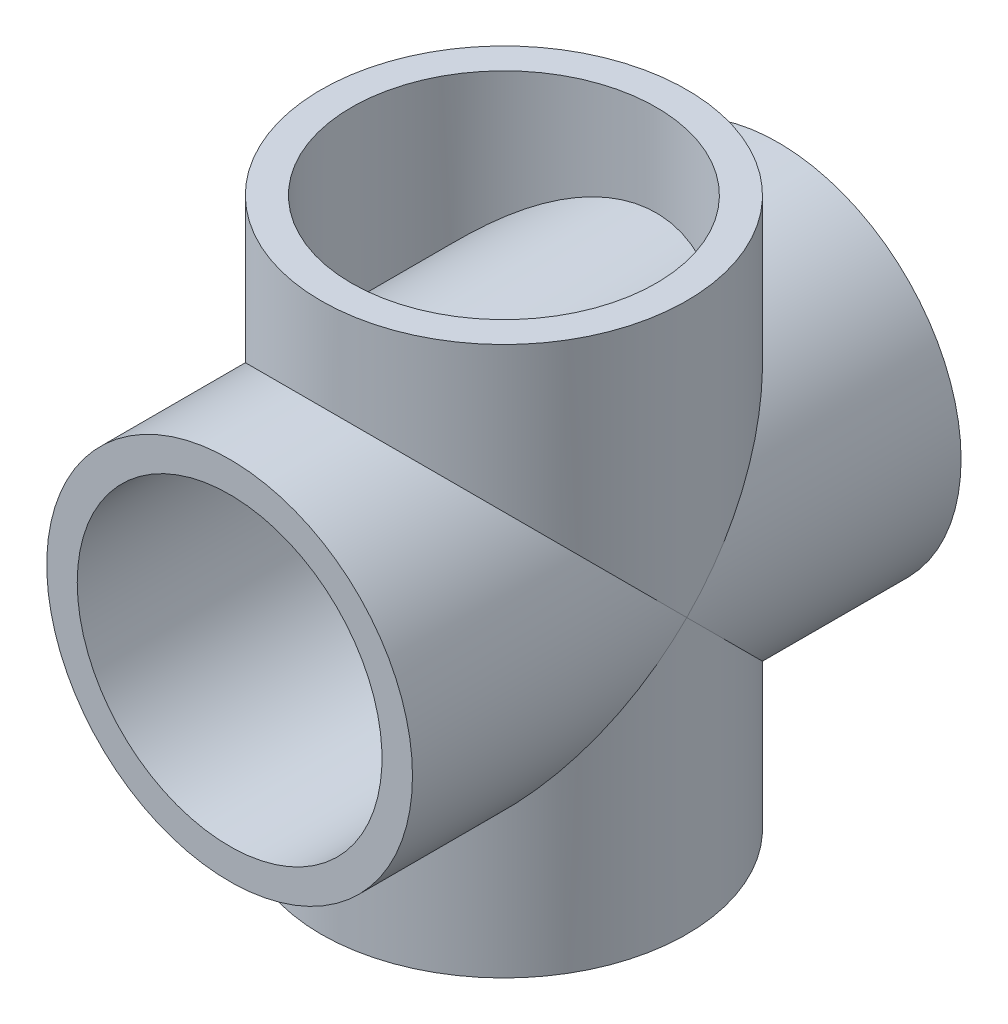
ISO-10303-21;
HEADER;
FILE_DESCRIPTION(('STEP AP214'),'2;1');
FILE_NAME('part.step','',(''),(''),'','','');
FILE_SCHEMA(('AUTOMOTIVE_DESIGN { 1 0 10303 214 1 1 1 1 }'));
ENDSEC;
DATA;
#1=APPLICATION_CONTEXT('core data for automotive mechanical design processes');
#2=APPLICATION_PROTOCOL_DEFINITION('international standard','automotive_design',2000,#1);
#3=PRODUCT_CONTEXT('',#1,'mechanical');
#4=PRODUCT('Part','Part','',(#3));
#5=PRODUCT_RELATED_PRODUCT_CATEGORY('part','',(#4));
#6=PRODUCT_DEFINITION_FORMATION('','',#4);
#7=PRODUCT_DEFINITION_CONTEXT('part definition',#1,'design');
#8=PRODUCT_DEFINITION('design','',#6,#7);
#9=PRODUCT_DEFINITION_SHAPE('','',#8);
#10=(LENGTH_UNIT() NAMED_UNIT(*) SI_UNIT(.MILLI.,.METRE.));
#11=(NAMED_UNIT(*) PLANE_ANGLE_UNIT() SI_UNIT($,.RADIAN.));
#12=(NAMED_UNIT(*) SI_UNIT($,.STERADIAN.) SOLID_ANGLE_UNIT());
#13=UNCERTAINTY_MEASURE_WITH_UNIT(LENGTH_MEASURE(1.E-05),#10,'distance_accuracy_value','');
#14=(GEOMETRIC_REPRESENTATION_CONTEXT(3) GLOBAL_UNCERTAINTY_ASSIGNED_CONTEXT((#13)) GLOBAL_UNIT_ASSIGNED_CONTEXT((#10,
#11,#12)) REPRESENTATION_CONTEXT('',''));
#15=CARTESIAN_POINT('',(0.,0.,0.));
#16=DIRECTION('',(0.,0.,1.));
#17=DIRECTION('',(1.,0.,0.));
#18=AXIS2_PLACEMENT_3D('',#15,#16,#17);
#19=CARTESIAN_POINT('',(0.,-9.,0.));
#20=DIRECTION('',(0.,1.,0.));
#21=DIRECTION('',(0.,0.,1.));
#22=AXIS2_PLACEMENT_3D('',#19,#20,#21);
#23=CYLINDRICAL_SURFACE('',#22,5.);
#24=CARTESIAN_POINT('',(0.,-6.,5.));
#25=CARTESIAN_POINT('',(0.118803401095405,-6.00000636279643,5.0000064862677));
#26=CARTESIAN_POINT('',(0.237558182871218,-5.9964675633917,4.99576243276274));
#27=CARTESIAN_POINT('',(0.474087838067091,-5.98241218121961,4.97888342242901));
#28=CARTESIAN_POINT('',(0.591862597565708,-5.97189479839916,4.96624750352265));
#29=CARTESIAN_POINT('',(0.825474733693952,-5.94410935213455,4.93280067838579));
#30=CARTESIAN_POINT('',(0.941311384241482,-5.92683881527392,4.9119867768663));
#31=CARTESIAN_POINT('',(1.17018155731566,-5.88593383048318,4.86255145148515));
#32=CARTESIAN_POINT('',(1.28321381003106,-5.86229655516696,4.83392655878944));
#33=CARTESIAN_POINT('',(1.61550772291657,-5.78287450226039,4.73740362240781));
#34=CARTESIAN_POINT('',(1.82964493287683,-5.71836951829061,4.65860789353558));
#35=CARTESIAN_POINT('',(2.23973970904935,-5.57056793109677,4.47594785576944));
#36=CARTESIAN_POINT('',(2.43569110189251,-5.48726497939233,4.37207507698348));
#37=CARTESIAN_POINT('',(2.7487493551036,-5.33520303254702,4.17931765246547));
#38=CARTESIAN_POINT('',(2.87121824175386,-5.27015451867263,4.09605321766379));
#39=CARTESIAN_POINT('',(3.10654667374618,-5.13495608214751,3.92057491487891));
#40=CARTESIAN_POINT('',(3.21940634431806,-5.06480622600091,3.82836116355909));
#41=CARTESIAN_POINT('',(3.43568816068562,-4.92066908923446,3.63553308278675));
#42=CARTESIAN_POINT('',(3.53908406033977,-4.84667197890407,3.53489678957743));
#43=CARTESIAN_POINT('',(3.73607907111508,-4.69649318853079,3.32600704379389));
#44=CARTESIAN_POINT('',(3.82967941338621,-4.62031178455679,3.21775455132494));
#45=CARTESIAN_POINT('',(4.00872533168448,-4.46590940619064,2.99186847524311));
#46=CARTESIAN_POINT('',(4.09398918746846,-4.38767669457347,2.87409893732901));
#47=CARTESIAN_POINT('',(4.25431125048952,-4.23240914046916,2.63097870098595));
#48=CARTESIAN_POINT('',(4.32936604026974,-4.15537470670733,2.50562548412932));
#49=CARTESIAN_POINT('',(4.46882104937819,-4.00501156130571,2.24746866950541));
#50=CARTESIAN_POINT('',(4.53324636625594,-3.93167441297209,2.11468364253878));
#51=CARTESIAN_POINT('',(4.65107409789266,-3.79155403229088,1.84110422364287));
#52=CARTESIAN_POINT('',(4.70448590476211,-3.72476524134073,1.70031678782893));
#53=CARTESIAN_POINT('',(4.8038705578035,-3.59583630496641,1.39667622874439));
#54=CARTESIAN_POINT('',(4.8486776643058,-3.53471789619366,1.23299156369288));
#55=CARTESIAN_POINT('',(4.92202476595886,-3.43187191424554,0.896180811817698));
#56=CARTESIAN_POINT('',(4.95060424437364,-3.39009732197608,0.723078773763434));
#57=CARTESIAN_POINT('',(4.97982440219376,-3.34688431376343,0.457661896369311));
#58=CARTESIAN_POINT('',(4.98729261982802,-3.33571370000033,0.367618679010191));
#59=CARTESIAN_POINT('',(4.99733565959028,-3.3206515347262,0.186635888055955));
#60=CARTESIAN_POINT('',(4.99991093928053,-3.31675930257913,0.09569639907507));
#61=CARTESIAN_POINT('',(5.00008454722765,-3.31649708247112,-0.0861953552895042));
#62=CARTESIAN_POINT('',(4.99768286475912,-3.32012711072076,-0.177147620700304));
#63=CARTESIAN_POINT('',(4.98797701095387,-3.33469045716225,-0.358199787378117));
#64=CARTESIAN_POINT('',(4.9806722424497,-3.34562466496004,-0.448299583463617));
#65=CARTESIAN_POINT('',(4.9605577711742,-3.37538324774709,-0.63429034598752));
#66=CARTESIAN_POINT('',(4.94734291419499,-3.3947851529219,-0.730044329719766));
#67=CARTESIAN_POINT('',(4.9157405398429,-3.44038747060614,-0.919072038911219));
#68=CARTESIAN_POINT('',(4.89734936269663,-3.46659269219059,-1.01234395824117));
#69=CARTESIAN_POINT('',(4.83487145070514,-3.55374344299518,-1.28826795172829));
#70=CARTESIAN_POINT('',(4.78352415648848,-3.62315426397916,-1.46664526370663));
#71=CARTESIAN_POINT('',(4.67632227850057,-3.76004871810486,-1.77568076874675));
#72=CARTESIAN_POINT('',(4.62355194613134,-3.82500795712383,-1.90862269999418));
#73=CARTESIAN_POINT('',(4.50808681272013,-3.96043831206372,-2.16730339944136));
#74=CARTESIAN_POINT('',(4.44538619181528,-4.03091264789804,-2.29303788433664));
#75=CARTESIAN_POINT('',(4.31043075762212,-4.17491879023624,-2.53766285158917));
#76=CARTESIAN_POINT('',(4.23816312441515,-4.24845460689311,-2.65654383781025));
#77=CARTESIAN_POINT('',(4.08435401417139,-4.39652708661221,-2.88743564285202));
#78=CARTESIAN_POINT('',(4.00281439970954,-4.47106354601934,-2.99944783455588));
#79=CARTESIAN_POINT('',(3.82600354374306,-4.62342077684068,-3.22226109628928));
#80=CARTESIAN_POINT('',(3.73023700414124,-4.70120929265264,-3.33269201981388));
#81=CARTESIAN_POINT('',(3.52848927170201,-4.85446404087317,-3.54559939981486));
#82=CARTESIAN_POINT('',(3.42250656330085,-4.92992992652313,-3.64807467199064));
#83=CARTESIAN_POINT('',(3.20056123189973,-5.07681645366273,-3.84425294796649));
#84=CARTESIAN_POINT('',(3.08461970676718,-5.14824514018381,-3.9379736595021));
#85=CARTESIAN_POINT('',(2.84274064052496,-5.28566109460446,-4.11599426421234));
#86=CARTESIAN_POINT('',(2.71680273442448,-5.35164816363854,-4.20029381312783));
#87=CARTESIAN_POINT('',(2.38827463214803,-5.50853314592501,-4.39878554184217));
#88=CARTESIAN_POINT('',(2.17932731194453,-5.59498946786027,-4.50631929530225));
#89=CARTESIAN_POINT('',(1.8513717036081,-5.7084038705407,-4.64613821914312));
#90=CARTESIAN_POINT('',(1.73959798407547,-5.74350440601256,-4.68917312218695));
#91=CARTESIAN_POINT('',(1.51170856686385,-5.80764297166477,-4.76751793421716));
#92=CARTESIAN_POINT('',(1.39559507719869,-5.83668403661188,-4.80283171060456));
#93=CARTESIAN_POINT('',(1.15874024023432,-5.88830518104936,-4.86543453319276));
#94=CARTESIAN_POINT('',(1.03796855116844,-5.91082981449132,-4.89265476556204));
#95=CARTESIAN_POINT('',(0.793680719841949,-5.94855722519953,-4.93816722227972));
#96=CARTESIAN_POINT('',(0.670165967971718,-5.96376362711192,-4.95646386645159));
#97=CARTESIAN_POINT('',(0.42144390913128,-5.98648272603519,-4.98377697031546));
#98=CARTESIAN_POINT('',(0.296237084023917,-5.99399756851713,-4.99279601788868));
#99=CARTESIAN_POINT('',(0.0452813606587585,-6.00114166173048,-5.00137053830483));
#100=CARTESIAN_POINT('',(-0.0804674771283864,-6.00077177047715,-5.00092704086014));
#101=CARTESIAN_POINT('',(-0.316217699577986,-5.99267919208227,-4.9912131909085));
#102=CARTESIAN_POINT('',(-0.426296149457819,-5.98584511760915,-4.98300958868131));
#103=CARTESIAN_POINT('',(-0.645178571447254,-5.96622340308935,-4.95942180024422));
#104=CARTESIAN_POINT('',(-0.753982136950648,-5.95343391393135,-4.94403538382096));
#105=CARTESIAN_POINT('',(-0.96950893257834,-5.922153588973,-4.90632392627914));
#106=CARTESIAN_POINT('',(-1.07623280976896,-5.90366455762228,-4.88400108118507));
#107=CARTESIAN_POINT('',(-1.28701083316512,-5.86132925877314,-4.83274114539643));
#108=CARTESIAN_POINT('',(-1.39106394571243,-5.83748095091222,-4.80380153552005));
#109=CARTESIAN_POINT('',(-1.70100357204864,-5.75780997966539,-4.70677908129298));
#110=CARTESIAN_POINT('',(-1.90197317990273,-5.69426548906173,-4.62897463511253));
#111=CARTESIAN_POINT('',(-2.28736622034062,-5.55070829820292,-4.45119251532421));
#112=CARTESIAN_POINT('',(-2.4717835011244,-5.47068951124314,-4.35120664535609));
#113=CARTESIAN_POINT('',(-2.77431022087587,-5.32196402989805,-4.16241303362758));
#114=CARTESIAN_POINT('',(-2.89671891082123,-5.25618753965957,-4.07807881363138));
#115=CARTESIAN_POINT('',(-3.13182124456801,-5.11958730343164,-3.90043631108395));
#116=CARTESIAN_POINT('',(-3.24451452031805,-5.04876336641404,-3.80712768883631));
#117=CARTESIAN_POINT('',(-3.46039828484842,-4.9033290991082,-3.61204642318574));
#118=CARTESIAN_POINT('',(-3.5635591655786,-4.82870801884464,-3.51024916115611));
#119=CARTESIAN_POINT('',(-3.75997885952874,-4.67738428016308,-3.29899388009149));
#120=CARTESIAN_POINT('',(-3.85323906840847,-4.60068191705467,-3.18953694443026));
#121=CARTESIAN_POINT('',(-4.03144708201688,-4.44540721169772,-2.96121350414877));
#122=CARTESIAN_POINT('',(-4.11621624228699,-4.3668259708409,-2.84221365304651));
#123=CARTESIAN_POINT('',(-4.27543853436326,-4.21106013919063,-2.59654816531047));
#124=CARTESIAN_POINT('',(-4.34988795406828,-4.13387605960317,-2.46987979366074));
#125=CARTESIAN_POINT('',(-4.48797579821677,-3.98352281099524,-2.20902653418022));
#126=CARTESIAN_POINT('',(-4.55164272839413,-3.91034341321279,-2.07486275313425));
#127=CARTESIAN_POINT('',(-4.66777738062598,-3.77095158572992,-1.79841659242433));
#128=CARTESIAN_POINT('',(-4.72025536508448,-3.70473280033071,-1.6561418052561));
#129=CARTESIAN_POINT('',(-4.81674752553354,-3.57850891369613,-1.35146946258282));
#130=CARTESIAN_POINT('',(-4.85976816309609,-3.51940536010279,-1.18836978046225));
#131=CARTESIAN_POINT('',(-4.92964324178358,-3.42087013106355,-0.85305750676159));
#132=CARTESIAN_POINT('',(-4.95653805629938,-3.38138936984465,-0.680868858020014));
#133=CARTESIAN_POINT('',(-4.98335884043903,-3.34161185607347,-0.417267118823414));
#134=CARTESIAN_POINT('',(-4.9900439743412,-3.33159299706687,-0.327939885729364));
#135=CARTESIAN_POINT('',(-4.99859875462369,-3.31874657694375,-0.148522532583947));
#136=CARTESIAN_POINT('',(-5.00046880529626,-3.31591841207014,-0.058432477219275));
#137=CARTESIAN_POINT('',(-4.99933140644564,-3.31763235091844,0.121644228189401));
#138=CARTESIAN_POINT('',(-4.99632384110741,-3.32217462964556,0.2116308757273));
#139=CARTESIAN_POINT('',(-4.98551920595953,-3.33836659549378,0.390705731690927));
#140=CARTESIAN_POINT('',(-4.97771962684741,-3.3500200062847,0.479793444537629));
#141=CARTESIAN_POINT('',(-4.95646386284238,-3.38139896959306,0.665670000297205));
#142=CARTESIAN_POINT('',(-4.94249693749092,-3.40184751901396,0.762277582327921));
#143=CARTESIAN_POINT('',(-4.90931375512976,-3.44956299936088,0.952897655384544));
#144=CARTESIAN_POINT('',(-4.89009367595844,-3.47683489368277,1.0469082017716));
#145=CARTESIAN_POINT('',(-4.82502893529809,-3.56715037769761,1.32490519247802));
#146=CARTESIAN_POINT('',(-4.7718260132866,-3.6386203494625,1.50447425917308));
#147=CARTESIAN_POINT('',(-4.66101333620415,-3.77905708413607,1.81560530153226));
#148=CARTESIAN_POINT('',(-4.60651894445035,-3.84555788327452,1.94948557461558));
#149=CARTESIAN_POINT('',(-4.48741065580201,-3.98390215298827,2.2098947178368));
#150=CARTESIAN_POINT('',(-4.42279087534716,-4.05574871700042,2.33641925480244));
#151=CARTESIAN_POINT('',(-4.2837858901639,-4.20230923095866,2.58247503937639));
#152=CARTESIAN_POINT('',(-4.20938767793866,-4.27702690475068,2.70199665984665));
#153=CARTESIAN_POINT('',(-4.0510934721615,-4.42725084654704,2.93399936330056));
#154=CARTESIAN_POINT('',(-3.96719939385688,-4.5027569527514,3.04648185894279));
#155=CARTESIAN_POINT('',(-3.78559728592261,-4.65661946215907,3.26970299172245));
#156=CARTESIAN_POINT('',(-3.68741297206341,-4.73493356113397,3.3800842070447));
#157=CARTESIAN_POINT('',(-3.48062708656674,-4.8889534769991,3.59266286414692));
#158=CARTESIAN_POINT('',(-3.37202387840541,-4.96465888158805,3.69485901563601));
#159=CARTESIAN_POINT('',(-3.14465963115799,-5.11169145947055,3.89018127821456));
#160=CARTESIAN_POINT('',(-3.02592088507468,-5.18302767756749,3.98332637820862));
#161=CARTESIAN_POINT('',(-2.77827797167403,-5.31988980472137,4.1598471824308));
#162=CARTESIAN_POINT('',(-2.64937275881186,-5.38541511469401,4.24322187964872));
#163=CARTESIAN_POINT('',(-2.3171577550575,-5.53880075702301,4.43658392581487));
#164=CARTESIAN_POINT('',(-2.10785901335211,-5.62226392609454,4.5401082380941));
#165=CARTESIAN_POINT('',(-1.78004652854698,-5.73103285742108,4.67390583373137));
#166=CARTESIAN_POINT('',(-1.66848545194812,-5.7645471565668,4.71491832045557));
#167=CARTESIAN_POINT('',(-1.44122911865484,-5.82552080229896,4.78927419077675));
#168=CARTESIAN_POINT('',(-1.32553443865741,-5.85298098971731,4.8226186393853));
#169=CARTESIAN_POINT('',(-1.01333234603958,-5.91714489125081,4.90034346391484));
#170=CARTESIAN_POINT('',(-0.813745597053212,-5.94804013902009,4.93754678243697));
#171=CARTESIAN_POINT('',(-0.409390797411382,-5.98946116455115,4.98736819813601));
#172=CARTESIAN_POINT('',(-0.204623282772271,-5.99998904091734,4.99998882825427));
#173=CARTESIAN_POINT('',(0.,-6.,5.));
#174=B_SPLINE_CURVE_WITH_KNOTS('',3,(#24,#25,#26,#27,#28,#29,#30,#31,#32,#33,#34,#35,#36,#37,
#38,#39,#40,#41,#42,#43,#44,#45,#46,#47,#48,#49,#50,#51,#52,#53,#54,#55,#56,#57,#58,#59,#60,#61,
#62,#63,#64,#65,#66,#67,#68,#69,#70,#71,#72,#73,#74,#75,#76,#77,#78,#79,#80,#81,#82,#83,#84,#85,
#86,#87,#88,#89,#90,#91,#92,#93,#94,#95,#96,#97,#98,#99,#100,#101,#102,#103,#104,#105,#106,#107,
#108,#109,#110,#111,#112,#113,#114,#115,#116,#117,#118,#119,#120,#121,#122,#123,#124,#125,#126,
#127,#128,#129,#130,#131,#132,#133,#134,#135,#136,#137,#138,#139,#140,#141,#142,#143,#144,#145,
#146,#147,#148,#149,#150,#151,#152,#153,#154,#155,#156,#157,#158,#159,#160,#161,#162,#163,#164,
#165,#166,#167,#168,#169,#170,#171,#172,#173),.UNSPECIFIED.,.T.,.F.,(4,2,2,2,2,2,2,2,2,2,2,2,2,
2,2,2,2,2,2,2,2,2,2,2,2,2,2,2,2,2,2,2,2,2,2,2,2,2,2,2,2,2,2,2,2,2,2,2,2,2,2,2,2,2,2,2,2,2,2,2,2,
2,2,2,2,2,2,2,2,2,2,2,2,2,4),(0.,0.356198531128419,0.712437905356867,1.06880787854775,
1.42533637270188,2.13333209783898,2.84156728725027,3.32622201622343,3.81087042808177,
4.29682459639559,4.78271761425373,5.27755036039961,5.77254834493272,6.26636031071476,
6.75974940543413,7.29936255278482,7.83765708456692,8.11040822806103,8.38313386402394,
8.65586008771504,8.92861953390792,9.22392701856221,9.51944381892724,10.1116379066242,
10.5823769120489,11.0533928323055,11.5250464324407,11.9966054526408,12.4928422896337,
12.9891528567514,13.484436760364,13.9797387562551,14.7274446962693,15.10150349884,
15.4753745093337,15.8523389140401,16.2291164194433,16.6057887984766,16.9824201883012,
17.3138076935885,17.6452981608744,17.9766837873554,18.3081957920453,18.9794342536,
19.6509211619365,20.1379627282136,20.6250227371037,21.1135480143902,21.6020043344423,
22.0992028034935,22.5965796576366,23.0926203414622,23.5882040850607,24.1228614856737,
24.6561746412001,24.9262177314022,25.196238147046,25.4662649741992,25.7364333195518,
26.0351569724179,26.3340985560114,26.9331443359533,27.4099325615984,27.8869988690867,
28.3647063284082,28.8423176087132,29.3434029116174,29.844567050611,30.3446559675372,
30.8447963820892,31.5852621624668,31.9553671316834,32.325420666041,32.9389891607904,
33.5524944315665),.UNSPECIFIED.);
#175=CARTESIAN_POINT('',(0.,-6.,5.));
#176=VERTEX_POINT('',#175);
#177=EDGE_CURVE('E36',#176,#176,#174,.T.);
#178=ORIENTED_EDGE('',*,*,#177,.T.);
#179=EDGE_LOOP('',(#178));
#180=FACE_BOUND('',#179,.T.);
#181=CARTESIAN_POINT('',(0.,-9.,0.));
#182=DIRECTION('',(0.,1.,0.));
#183=DIRECTION('',(0.,0.,1.));
#184=AXIS2_PLACEMENT_3D('',#181,#182,#183);
#185=CIRCLE('',#184,5.);
#186=CARTESIAN_POINT('',(0.,-9.,5.));
#187=VERTEX_POINT('',#186);
#188=EDGE_CURVE('E45',#187,#187,#185,.T.);
#189=ORIENTED_EDGE('',*,*,#188,.F.);
#190=EDGE_LOOP('',(#189));
#191=FACE_BOUND('',#190,.T.);
#192=ADVANCED_FACE('F32',(#180,#191),#23,.F.);
#193=CARTESIAN_POINT('',(0.,-9.,0.));
#194=DIRECTION('',(0.,1.,0.));
#195=DIRECTION('',(0.,0.,1.));
#196=AXIS2_PLACEMENT_3D('',#193,#194,#195);
#197=CYLINDRICAL_SURFACE('',#196,6.);
#198=CARTESIAN_POINT('',(0.,0.,0.));
#199=DIRECTION('',(0.,0.707106781186547,0.707106781186547));
#200=DIRECTION('',(0.,0.707106781186547,-0.707106781186547));
#201=AXIS2_PLACEMENT_3D('',#198,#199,#200);
#202=ELLIPSE('',#201,8.48528137423857,6.);
#203=CARTESIAN_POINT('',(-6.,0.,0.));
#204=VERTEX_POINT('',#203);
#205=CARTESIAN_POINT('',(6.,0.,0.));
#206=VERTEX_POINT('',#205);
#207=EDGE_CURVE('E60',#204,#206,#202,.T.);
#208=ORIENTED_EDGE('',*,*,#207,.F.);
#209=CARTESIAN_POINT('',(0.,0.,0.));
#210=DIRECTION('',(0.,0.707106781186547,-0.707106781186547));
#211=DIRECTION('',(0.,0.707106781186547,0.707106781186547));
#212=AXIS2_PLACEMENT_3D('',#209,#210,#211);
#213=ELLIPSE('',#212,8.48528137423857,6.);
#214=EDGE_CURVE('E58',#206,#204,#213,.T.);
#215=ORIENTED_EDGE('',*,*,#214,.F.);
#216=EDGE_LOOP('',(#208,#215));
#217=FACE_BOUND('',#216,.T.);
#218=CARTESIAN_POINT('',(0.,-9.,0.));
#219=DIRECTION('',(0.,1.,0.));
#220=DIRECTION('',(0.,0.,1.));
#221=AXIS2_PLACEMENT_3D('',#218,#219,#220);
#222=CIRCLE('',#221,6.);
#223=CARTESIAN_POINT('',(0.,-9.,6.));
#224=VERTEX_POINT('',#223);
#225=EDGE_CURVE('E11',#224,#224,#222,.T.);
#226=ORIENTED_EDGE('',*,*,#225,.T.);
#227=EDGE_LOOP('',(#226));
#228=FACE_BOUND('',#227,.T.);
#229=ADVANCED_FACE('F34',(#217,#228),#197,.T.);
#230=CARTESIAN_POINT('',(0.,-9.,0.));
#231=DIRECTION('',(0.,1.,0.));
#232=DIRECTION('',(0.,0.,1.));
#233=AXIS2_PLACEMENT_3D('',#230,#231,#232);
#234=PLANE('',#233);
#235=ORIENTED_EDGE('',*,*,#188,.T.);
#236=EDGE_LOOP('',(#235));
#237=FACE_BOUND('',#236,.T.);
#238=ORIENTED_EDGE('',*,*,#225,.F.);
#239=EDGE_LOOP('',(#238));
#240=FACE_BOUND('',#239,.T.);
#241=ADVANCED_FACE('F111',(#237,#240),#234,.F.);
#242=CARTESIAN_POINT('',(0.,0.,-9.));
#243=DIRECTION('',(0.,0.,1.));
#244=DIRECTION('',(1.,0.,0.));
#245=AXIS2_PLACEMENT_3D('',#242,#243,#244);
#246=CYLINDRICAL_SURFACE('',#245,6.);
#247=ORIENTED_EDGE('',*,*,#177,.F.);
#248=EDGE_LOOP('',(#247));
#249=FACE_BOUND('',#248,.T.);
#250=ADVANCED_FACE('F119',(#249),#246,.T.);
#251=CARTESIAN_POINT('',(0.,0.,9.));
#252=DIRECTION('',(0.,0.,1.));
#253=DIRECTION('',(1.,0.,0.));
#254=AXIS2_PLACEMENT_3D('',#251,#252,#253);
#255=PLANE('',#254);
#256=CARTESIAN_POINT('',(0.,0.,9.));
#257=DIRECTION('',(0.,0.,-1.));
#258=DIRECTION('',(-1.,0.,0.));
#259=AXIS2_PLACEMENT_3D('',#256,#257,#258);
#260=CIRCLE('',#259,5.);
#261=CARTESIAN_POINT('',(-5.,0.,9.));
#262=VERTEX_POINT('',#261);
#263=EDGE_CURVE('E141',#262,#262,#260,.T.);
#264=ORIENTED_EDGE('',*,*,#263,.T.);
#265=EDGE_LOOP('',(#264));
#266=FACE_BOUND('',#265,.T.);
#267=CARTESIAN_POINT('',(0.,0.,9.));
#268=DIRECTION('',(0.,0.,1.));
#269=DIRECTION('',(1.,0.,0.));
#270=AXIS2_PLACEMENT_3D('',#267,#268,#269);
#271=CIRCLE('',#270,6.);
#272=CARTESIAN_POINT('',(6.,0.,9.));
#273=VERTEX_POINT('',#272);
#274=EDGE_CURVE('E139',#273,#273,#271,.T.);
#275=ORIENTED_EDGE('',*,*,#274,.T.);
#276=EDGE_LOOP('',(#275));
#277=FACE_BOUND('',#276,.T.);
#278=ADVANCED_FACE('F124',(#266,#277),#255,.T.);
#279=ORIENTED_EDGE('',*,*,#274,.F.);
#280=EDGE_LOOP('',(#279));
#281=FACE_BOUND('',#280,.T.);
#282=CARTESIAN_POINT('',(0.,0.,0.));
#283=DIRECTION('',(0.,0.707106781186547,-0.707106781186547));
#284=DIRECTION('',(0.,0.707106781186547,0.707106781186547));
#285=AXIS2_PLACEMENT_3D('',#282,#283,#284);
#286=ELLIPSE('',#285,8.48528137423857,6.);
#287=EDGE_CURVE('E52',#206,#204,#286,.F.);
#288=ORIENTED_EDGE('',*,*,#287,.T.);
#289=ORIENTED_EDGE('',*,*,#207,.T.);
#290=EDGE_LOOP('',(#288,#289));
#291=FACE_BOUND('',#290,.T.);
#292=ADVANCED_FACE('F69',(#281,#291),#246,.T.);
#293=ORIENTED_EDGE('',*,*,#214,.T.);
#294=CARTESIAN_POINT('',(0.,0.,0.));
#295=DIRECTION('',(0.,0.707106781186547,0.707106781186547));
#296=DIRECTION('',(0.,0.707106781186547,-0.707106781186547));
#297=AXIS2_PLACEMENT_3D('',#294,#295,#296);
#298=ELLIPSE('',#297,8.48528137423857,6.);
#299=EDGE_CURVE('E67',#204,#206,#298,.F.);
#300=ORIENTED_EDGE('',*,*,#299,.T.);
#301=EDGE_LOOP('',(#293,#300));
#302=FACE_BOUND('',#301,.T.);
#303=CARTESIAN_POINT('',(0.,0.,-9.));
#304=DIRECTION('',(0.,0.,1.));
#305=DIRECTION('',(1.,0.,0.));
#306=AXIS2_PLACEMENT_3D('',#303,#304,#305);
#307=CIRCLE('',#306,6.);
#308=CARTESIAN_POINT('',(6.,0.,-9.));
#309=VERTEX_POINT('',#308);
#310=EDGE_CURVE('E86',#309,#309,#307,.T.);
#311=ORIENTED_EDGE('',*,*,#310,.T.);
#312=EDGE_LOOP('',(#311));
#313=FACE_BOUND('',#312,.T.);
#314=ADVANCED_FACE('F71',(#302,#313),#246,.T.);
#315=CARTESIAN_POINT('',(0.,0.,-9.));
#316=DIRECTION('',(0.,0.,1.));
#317=DIRECTION('',(1.,0.,0.));
#318=AXIS2_PLACEMENT_3D('',#315,#316,#317);
#319=PLANE('',#318);
#320=CARTESIAN_POINT('',(0.,0.,-9.));
#321=DIRECTION('',(0.,0.,-1.));
#322=DIRECTION('',(-1.,0.,0.));
#323=AXIS2_PLACEMENT_3D('',#320,#321,#322);
#324=CIRCLE('',#323,5.);
#325=CARTESIAN_POINT('',(-5.,0.,-9.));
#326=VERTEX_POINT('',#325);
#327=EDGE_CURVE('E146',#326,#326,#324,.T.);
#328=ORIENTED_EDGE('',*,*,#327,.F.);
#329=EDGE_LOOP('',(#328));
#330=FACE_BOUND('',#329,.T.);
#331=ORIENTED_EDGE('',*,*,#310,.F.);
#332=EDGE_LOOP('',(#331));
#333=FACE_BOUND('',#332,.T.);
#334=ADVANCED_FACE('F93',(#330,#333),#319,.F.);
#335=ORIENTED_EDGE('',*,*,#299,.F.);
#336=ORIENTED_EDGE('',*,*,#287,.F.);
#337=EDGE_LOOP('',(#335,#336));
#338=FACE_BOUND('',#337,.T.);
#339=CARTESIAN_POINT('',(0.,9.,0.));
#340=DIRECTION('',(0.,1.,0.));
#341=DIRECTION('',(0.,0.,1.));
#342=AXIS2_PLACEMENT_3D('',#339,#340,#341);
#343=CIRCLE('',#342,6.);
#344=CARTESIAN_POINT('',(0.,9.,6.));
#345=VERTEX_POINT('',#344);
#346=EDGE_CURVE('E76',#345,#345,#343,.T.);
#347=ORIENTED_EDGE('',*,*,#346,.F.);
#348=EDGE_LOOP('',(#347));
#349=FACE_BOUND('',#348,.T.);
#350=ADVANCED_FACE('F65',(#338,#349),#197,.T.);
#351=CARTESIAN_POINT('',(0.,9.,0.));
#352=DIRECTION('',(0.,1.,0.));
#353=DIRECTION('',(0.,0.,1.));
#354=AXIS2_PLACEMENT_3D('',#351,#352,#353);
#355=PLANE('',#354);
#356=ORIENTED_EDGE('',*,*,#346,.T.);
#357=EDGE_LOOP('',(#356));
#358=FACE_BOUND('',#357,.T.);
#359=CARTESIAN_POINT('',(0.,9.,0.));
#360=DIRECTION('',(0.,1.,0.));
#361=DIRECTION('',(0.,0.,1.));
#362=AXIS2_PLACEMENT_3D('',#359,#360,#361);
#363=CIRCLE('',#362,5.);
#364=CARTESIAN_POINT('',(0.,9.,5.));
#365=VERTEX_POINT('',#364);
#366=EDGE_CURVE('E73',#365,#365,#363,.T.);
#367=ORIENTED_EDGE('',*,*,#366,.F.);
#368=EDGE_LOOP('',(#367));
#369=FACE_BOUND('',#368,.T.);
#370=ADVANCED_FACE('F96',(#358,#369),#355,.T.);
#371=CARTESIAN_POINT('',(0.,6.,5.));
#372=CARTESIAN_POINT('',(-0.118803401095405,6.00000636279643,5.0000064862677));
#373=CARTESIAN_POINT('',(-0.237558182871218,5.9964675633917,4.99576243276274));
#374=CARTESIAN_POINT('',(-0.474087838067091,5.98241218121961,4.97888342242901));
#375=CARTESIAN_POINT('',(-0.591862597565708,5.97189479839916,4.96624750352265));
#376=CARTESIAN_POINT('',(-0.825474733693952,5.94410935213455,4.93280067838579));
#377=CARTESIAN_POINT('',(-0.941311384241482,5.92683881527392,4.9119867768663));
#378=CARTESIAN_POINT('',(-1.17018155731566,5.88593383048318,4.86255145148515));
#379=CARTESIAN_POINT('',(-1.28321381003106,5.86229655516696,4.83392655878944));
#380=CARTESIAN_POINT('',(-1.61550772291657,5.78287450226039,4.73740362240781));
#381=CARTESIAN_POINT('',(-1.82964493287683,5.71836951829061,4.65860789353558));
#382=CARTESIAN_POINT('',(-2.23973970904935,5.57056793109677,4.47594785576944));
#383=CARTESIAN_POINT('',(-2.43569110189251,5.48726497939233,4.37207507698348));
#384=CARTESIAN_POINT('',(-2.7487493551036,5.33520303254702,4.17931765246547));
#385=CARTESIAN_POINT('',(-2.87121824175386,5.27015451867263,4.09605321766379));
#386=CARTESIAN_POINT('',(-3.10654667374618,5.13495608214751,3.92057491487891));
#387=CARTESIAN_POINT('',(-3.21940634431806,5.06480622600091,3.82836116355909));
#388=CARTESIAN_POINT('',(-3.43568816068562,4.92066908923446,3.63553308278675));
#389=CARTESIAN_POINT('',(-3.53908406033977,4.84667197890407,3.53489678957743));
#390=CARTESIAN_POINT('',(-3.73607907111508,4.69649318853079,3.32600704379389));
#391=CARTESIAN_POINT('',(-3.82967941338621,4.62031178455679,3.21775455132494));
#392=CARTESIAN_POINT('',(-4.00872533168448,4.46590940619064,2.99186847524311));
#393=CARTESIAN_POINT('',(-4.09398918746846,4.38767669457347,2.87409893732901));
#394=CARTESIAN_POINT('',(-4.25431125048952,4.23240914046916,2.63097870098595));
#395=CARTESIAN_POINT('',(-4.32936604026974,4.15537470670733,2.50562548412932));
#396=CARTESIAN_POINT('',(-4.46882104937819,4.00501156130571,2.24746866950541));
#397=CARTESIAN_POINT('',(-4.53324636625594,3.93167441297209,2.11468364253878));
#398=CARTESIAN_POINT('',(-4.65107409789266,3.79155403229088,1.84110422364287));
#399=CARTESIAN_POINT('',(-4.70448590476211,3.72476524134073,1.70031678782893));
#400=CARTESIAN_POINT('',(-4.8038705578035,3.59583630496641,1.39667622874439));
#401=CARTESIAN_POINT('',(-4.8486776643058,3.53471789619366,1.23299156369288));
#402=CARTESIAN_POINT('',(-4.92202476595886,3.43187191424554,0.896180811817698));
#403=CARTESIAN_POINT('',(-4.95060424437364,3.39009732197608,0.723078773763434));
#404=CARTESIAN_POINT('',(-4.97982440219376,3.34688431376343,0.457661896369311));
#405=CARTESIAN_POINT('',(-4.98729261982802,3.33571370000033,0.367618679010191));
#406=CARTESIAN_POINT('',(-4.99733565959028,3.3206515347262,0.186635888055955));
#407=CARTESIAN_POINT('',(-4.99991093928053,3.31675930257913,0.09569639907507));
#408=CARTESIAN_POINT('',(-5.00008454722765,3.31649708247112,-0.0861953552895042));
#409=CARTESIAN_POINT('',(-4.99768286475912,3.32012711072076,-0.177147620700304));
#410=CARTESIAN_POINT('',(-4.98797701095387,3.33469045716225,-0.358199787378117));
#411=CARTESIAN_POINT('',(-4.9806722424497,3.34562466496004,-0.448299583463617));
#412=CARTESIAN_POINT('',(-4.9605577711742,3.37538324774709,-0.63429034598752));
#413=CARTESIAN_POINT('',(-4.94734291419499,3.3947851529219,-0.730044329719766));
#414=CARTESIAN_POINT('',(-4.9157405398429,3.44038747060614,-0.919072038911219));
#415=CARTESIAN_POINT('',(-4.89734936269663,3.46659269219059,-1.01234395824117));
#416=CARTESIAN_POINT('',(-4.83487145070514,3.55374344299518,-1.28826795172829));
#417=CARTESIAN_POINT('',(-4.78352415648848,3.62315426397916,-1.46664526370663));
#418=CARTESIAN_POINT('',(-4.67632227850057,3.76004871810486,-1.77568076874675));
#419=CARTESIAN_POINT('',(-4.62355194613134,3.82500795712383,-1.90862269999418));
#420=CARTESIAN_POINT('',(-4.50808681272013,3.96043831206372,-2.16730339944136));
#421=CARTESIAN_POINT('',(-4.44538619181528,4.03091264789804,-2.29303788433664));
#422=CARTESIAN_POINT('',(-4.31043075762212,4.17491879023624,-2.53766285158917));
#423=CARTESIAN_POINT('',(-4.23816312441515,4.24845460689311,-2.65654383781025));
#424=CARTESIAN_POINT('',(-4.08435401417139,4.39652708661221,-2.88743564285202));
#425=CARTESIAN_POINT('',(-4.00281439970954,4.47106354601934,-2.99944783455588));
#426=CARTESIAN_POINT('',(-3.82600354374306,4.62342077684068,-3.22226109628928));
#427=CARTESIAN_POINT('',(-3.73023700414124,4.70120929265264,-3.33269201981388));
#428=CARTESIAN_POINT('',(-3.52848927170201,4.85446404087317,-3.54559939981486));
#429=CARTESIAN_POINT('',(-3.42250656330085,4.92992992652313,-3.64807467199064));
#430=CARTESIAN_POINT('',(-3.20056123189973,5.07681645366273,-3.84425294796649));
#431=CARTESIAN_POINT('',(-3.08461970676718,5.14824514018381,-3.9379736595021));
#432=CARTESIAN_POINT('',(-2.84274064052496,5.28566109460446,-4.11599426421234));
#433=CARTESIAN_POINT('',(-2.71680273442448,5.35164816363854,-4.20029381312783));
#434=CARTESIAN_POINT('',(-2.38827463214803,5.50853314592501,-4.39878554184217));
#435=CARTESIAN_POINT('',(-2.17932731194453,5.59498946786027,-4.50631929530225));
#436=CARTESIAN_POINT('',(-1.8513717036081,5.7084038705407,-4.64613821914312));
#437=CARTESIAN_POINT('',(-1.73959798407547,5.74350440601256,-4.68917312218695));
#438=CARTESIAN_POINT('',(-1.51170856686385,5.80764297166477,-4.76751793421716));
#439=CARTESIAN_POINT('',(-1.39559507719869,5.83668403661188,-4.80283171060456));
#440=CARTESIAN_POINT('',(-1.15874024023432,5.88830518104936,-4.86543453319276));
#441=CARTESIAN_POINT('',(-1.03796855116844,5.91082981449132,-4.89265476556204));
#442=CARTESIAN_POINT('',(-0.793680719841949,5.94855722519953,-4.93816722227972));
#443=CARTESIAN_POINT('',(-0.670165967971718,5.96376362711192,-4.95646386645159));
#444=CARTESIAN_POINT('',(-0.42144390913128,5.98648272603519,-4.98377697031546));
#445=CARTESIAN_POINT('',(-0.296237084023917,5.99399756851713,-4.99279601788868));
#446=CARTESIAN_POINT('',(-0.0452813606587585,6.00114166173048,-5.00137053830483));
#447=CARTESIAN_POINT('',(0.0804674771283864,6.00077177047715,-5.00092704086014));
#448=CARTESIAN_POINT('',(0.316217699577986,5.99267919208227,-4.9912131909085));
#449=CARTESIAN_POINT('',(0.426296149457819,5.98584511760915,-4.98300958868131));
#450=CARTESIAN_POINT('',(0.645178571447254,5.96622340308935,-4.95942180024422));
#451=CARTESIAN_POINT('',(0.753982136950648,5.95343391393135,-4.94403538382096));
#452=CARTESIAN_POINT('',(0.96950893257834,5.922153588973,-4.90632392627914));
#453=CARTESIAN_POINT('',(1.07623280976896,5.90366455762228,-4.88400108118507));
#454=CARTESIAN_POINT('',(1.28701083316512,5.86132925877314,-4.83274114539643));
#455=CARTESIAN_POINT('',(1.39106394571243,5.83748095091222,-4.80380153552005));
#456=CARTESIAN_POINT('',(1.70100357204864,5.75780997966539,-4.70677908129298));
#457=CARTESIAN_POINT('',(1.90197317990273,5.69426548906173,-4.62897463511253));
#458=CARTESIAN_POINT('',(2.28736622034062,5.55070829820292,-4.45119251532421));
#459=CARTESIAN_POINT('',(2.4717835011244,5.47068951124314,-4.35120664535609));
#460=CARTESIAN_POINT('',(2.77431022087587,5.32196402989805,-4.16241303362758));
#461=CARTESIAN_POINT('',(2.89671891082123,5.25618753965957,-4.07807881363138));
#462=CARTESIAN_POINT('',(3.13182124456801,5.11958730343164,-3.90043631108395));
#463=CARTESIAN_POINT('',(3.24451452031805,5.04876336641404,-3.80712768883631));
#464=CARTESIAN_POINT('',(3.46039828484842,4.9033290991082,-3.61204642318574));
#465=CARTESIAN_POINT('',(3.5635591655786,4.82870801884464,-3.51024916115611));
#466=CARTESIAN_POINT('',(3.75997885952874,4.67738428016308,-3.29899388009149));
#467=CARTESIAN_POINT('',(3.85323906840847,4.60068191705467,-3.18953694443026));
#468=CARTESIAN_POINT('',(4.03144708201688,4.44540721169772,-2.96121350414877));
#469=CARTESIAN_POINT('',(4.11621624228699,4.3668259708409,-2.84221365304651));
#470=CARTESIAN_POINT('',(4.27543853436326,4.21106013919063,-2.59654816531047));
#471=CARTESIAN_POINT('',(4.34988795406828,4.13387605960317,-2.46987979366074));
#472=CARTESIAN_POINT('',(4.48797579821677,3.98352281099524,-2.20902653418022));
#473=CARTESIAN_POINT('',(4.55164272839413,3.91034341321279,-2.07486275313425));
#474=CARTESIAN_POINT('',(4.66777738062598,3.77095158572992,-1.79841659242433));
#475=CARTESIAN_POINT('',(4.72025536508448,3.70473280033071,-1.6561418052561));
#476=CARTESIAN_POINT('',(4.81674752553354,3.57850891369613,-1.35146946258282));
#477=CARTESIAN_POINT('',(4.85976816309609,3.51940536010279,-1.18836978046225));
#478=CARTESIAN_POINT('',(4.92964324178358,3.42087013106355,-0.85305750676159));
#479=CARTESIAN_POINT('',(4.95653805629938,3.38138936984465,-0.680868858020014));
#480=CARTESIAN_POINT('',(4.98335884043903,3.34161185607347,-0.417267118823414));
#481=CARTESIAN_POINT('',(4.9900439743412,3.33159299706687,-0.327939885729364));
#482=CARTESIAN_POINT('',(4.99859875462369,3.31874657694375,-0.148522532583947));
#483=CARTESIAN_POINT('',(5.00046880529626,3.31591841207014,-0.058432477219275));
#484=CARTESIAN_POINT('',(4.99933140644564,3.31763235091844,0.121644228189401));
#485=CARTESIAN_POINT('',(4.99632384110741,3.32217462964556,0.2116308757273));
#486=CARTESIAN_POINT('',(4.98551920595953,3.33836659549378,0.390705731690927));
#487=CARTESIAN_POINT('',(4.97771962684741,3.3500200062847,0.479793444537629));
#488=CARTESIAN_POINT('',(4.95646386284238,3.38139896959306,0.665670000297205));
#489=CARTESIAN_POINT('',(4.94249693749092,3.40184751901396,0.762277582327921));
#490=CARTESIAN_POINT('',(4.90931375512976,3.44956299936088,0.952897655384544));
#491=CARTESIAN_POINT('',(4.89009367595844,3.47683489368277,1.0469082017716));
#492=CARTESIAN_POINT('',(4.82502893529809,3.56715037769761,1.32490519247802));
#493=CARTESIAN_POINT('',(4.7718260132866,3.6386203494625,1.50447425917308));
#494=CARTESIAN_POINT('',(4.66101333620415,3.77905708413607,1.81560530153226));
#495=CARTESIAN_POINT('',(4.60651894445035,3.84555788327452,1.94948557461558));
#496=CARTESIAN_POINT('',(4.48741065580201,3.98390215298827,2.2098947178368));
#497=CARTESIAN_POINT('',(4.42279087534716,4.05574871700042,2.33641925480244));
#498=CARTESIAN_POINT('',(4.2837858901639,4.20230923095866,2.58247503937639));
#499=CARTESIAN_POINT('',(4.20938767793866,4.27702690475068,2.70199665984665));
#500=CARTESIAN_POINT('',(4.0510934721615,4.42725084654704,2.93399936330056));
#501=CARTESIAN_POINT('',(3.96719939385688,4.5027569527514,3.04648185894279));
#502=CARTESIAN_POINT('',(3.78559728592261,4.65661946215907,3.26970299172245));
#503=CARTESIAN_POINT('',(3.68741297206341,4.73493356113397,3.3800842070447));
#504=CARTESIAN_POINT('',(3.48062708656674,4.8889534769991,3.59266286414692));
#505=CARTESIAN_POINT('',(3.37202387840541,4.96465888158805,3.69485901563601));
#506=CARTESIAN_POINT('',(3.14465963115799,5.11169145947055,3.89018127821456));
#507=CARTESIAN_POINT('',(3.02592088507468,5.18302767756749,3.98332637820862));
#508=CARTESIAN_POINT('',(2.77827797167403,5.31988980472137,4.1598471824308));
#509=CARTESIAN_POINT('',(2.64937275881186,5.38541511469401,4.24322187964872));
#510=CARTESIAN_POINT('',(2.3171577550575,5.53880075702301,4.43658392581487));
#511=CARTESIAN_POINT('',(2.10785901335211,5.62226392609454,4.5401082380941));
#512=CARTESIAN_POINT('',(1.78004652854698,5.73103285742108,4.67390583373137));
#513=CARTESIAN_POINT('',(1.66848545194812,5.7645471565668,4.71491832045557));
#514=CARTESIAN_POINT('',(1.44122911865484,5.82552080229896,4.78927419077675));
#515=CARTESIAN_POINT('',(1.32553443865741,5.85298098971731,4.8226186393853));
#516=CARTESIAN_POINT('',(1.01333234603958,5.91714489125081,4.90034346391484));
#517=CARTESIAN_POINT('',(0.813745597053212,5.94804013902009,4.93754678243697));
#518=CARTESIAN_POINT('',(0.409390797411382,5.98946116455115,4.98736819813601));
#519=CARTESIAN_POINT('',(0.204623282772271,5.99998904091734,4.99998882825427));
#520=CARTESIAN_POINT('',(0.,6.,5.));
#521=B_SPLINE_CURVE_WITH_KNOTS('',3,(#371,#372,#373,#374,#375,#376,#377,#378,#379,#380,#381,
#382,#383,#384,#385,#386,#387,#388,#389,#390,#391,#392,#393,#394,#395,#396,#397,#398,#399,#400,
#401,#402,#403,#404,#405,#406,#407,#408,#409,#410,#411,#412,#413,#414,#415,#416,#417,#418,#419,
#420,#421,#422,#423,#424,#425,#426,#427,#428,#429,#430,#431,#432,#433,#434,#435,#436,#437,#438,
#439,#440,#441,#442,#443,#444,#445,#446,#447,#448,#449,#450,#451,#452,#453,#454,#455,#456,#457,
#458,#459,#460,#461,#462,#463,#464,#465,#466,#467,#468,#469,#470,#471,#472,#473,#474,#475,#476,
#477,#478,#479,#480,#481,#482,#483,#484,#485,#486,#487,#488,#489,#490,#491,#492,#493,#494,#495,
#496,#497,#498,#499,#500,#501,#502,#503,#504,#505,#506,#507,#508,#509,#510,#511,#512,#513,#514,
#515,#516,#517,#518,#519,#520),.UNSPECIFIED.,.T.,.F.,(4,2,2,2,2,2,2,2,2,2,2,2,2,2,2,2,2,2,2,2,2,
2,2,2,2,2,2,2,2,2,2,2,2,2,2,2,2,2,2,2,2,2,2,2,2,2,2,2,2,2,2,2,2,2,2,2,2,2,2,2,2,2,2,2,2,2,2,2,2,
2,2,2,2,2,4),(0.,0.356198531128419,0.712437905356867,1.06880787854775,1.42533637270188,
2.13333209783898,2.84156728725027,3.32622201622343,3.81087042808177,4.29682459639559,
4.78271761425373,5.27755036039961,5.77254834493272,6.26636031071476,6.75974940543413,
7.29936255278482,7.83765708456692,8.11040822806103,8.38313386402394,8.65586008771504,
8.92861953390792,9.22392701856221,9.51944381892724,10.1116379066242,10.5823769120489,
11.0533928323055,11.5250464324407,11.9966054526408,12.4928422896337,12.9891528567514,
13.484436760364,13.9797387562551,14.7274446962693,15.10150349884,15.4753745093337,
15.8523389140401,16.2291164194433,16.6057887984766,16.9824201883012,17.3138076935885,
17.6452981608744,17.9766837873554,18.3081957920453,18.9794342536,19.6509211619365,
20.1379627282136,20.6250227371037,21.1135480143902,21.6020043344423,22.0992028034935,
22.5965796576366,23.0926203414622,23.5882040850607,24.1228614856737,24.6561746412001,
24.9262177314022,25.196238147046,25.4662649741992,25.7364333195518,26.0351569724179,
26.3340985560114,26.9331443359533,27.4099325615984,27.8869988690867,28.3647063284082,
28.8423176087132,29.3434029116174,29.844567050611,30.3446559675372,30.8447963820892,
31.5852621624668,31.9553671316834,32.325420666041,32.9389891607904,33.5524944315665),.UNSPECIFIED.);
#522=CARTESIAN_POINT('',(0.,6.,5.));
#523=VERTEX_POINT('',#522);
#524=EDGE_CURVE('E82',#523,#523,#521,.T.);
#525=ORIENTED_EDGE('',*,*,#524,.T.);
#526=EDGE_LOOP('',(#525));
#527=FACE_BOUND('',#526,.T.);
#528=ORIENTED_EDGE('',*,*,#366,.T.);
#529=EDGE_LOOP('',(#528));
#530=FACE_BOUND('',#529,.T.);
#531=ADVANCED_FACE('F87',(#527,#530),#23,.F.);
#532=ORIENTED_EDGE('',*,*,#524,.F.);
#533=EDGE_LOOP('',(#532));
#534=FACE_BOUND('',#533,.T.);
#535=ADVANCED_FACE('F94',(#534),#246,.T.);
#536=CARTESIAN_POINT('',(0.,0.,9.));
#537=DIRECTION('',(0.,0.,-1.));
#538=DIRECTION('',(-1.,0.,0.));
#539=AXIS2_PLACEMENT_3D('',#536,#537,#538);
#540=CYLINDRICAL_SURFACE('',#539,5.);
#541=ORIENTED_EDGE('',*,*,#263,.F.);
#542=EDGE_LOOP('',(#541));
#543=FACE_BOUND('',#542,.T.);
#544=ORIENTED_EDGE('',*,*,#327,.T.);
#545=EDGE_LOOP('',(#544));
#546=FACE_BOUND('',#545,.T.);
#547=ADVANCED_FACE('F131',(#543,#546),#540,.F.);
#548=CLOSED_SHELL('',(#192,#229,#241,#250,#278,#292,#314,#334,#350,#370,#531,#535,#547));
#549=MANIFOLD_SOLID_BREP('B2',#548);
#550=ADVANCED_BREP_SHAPE_REPRESENTATION('',(#18,#549),#14);
#551=SHAPE_DEFINITION_REPRESENTATION(#9,#550);
ENDSEC;
END-ISO-10303-21;
